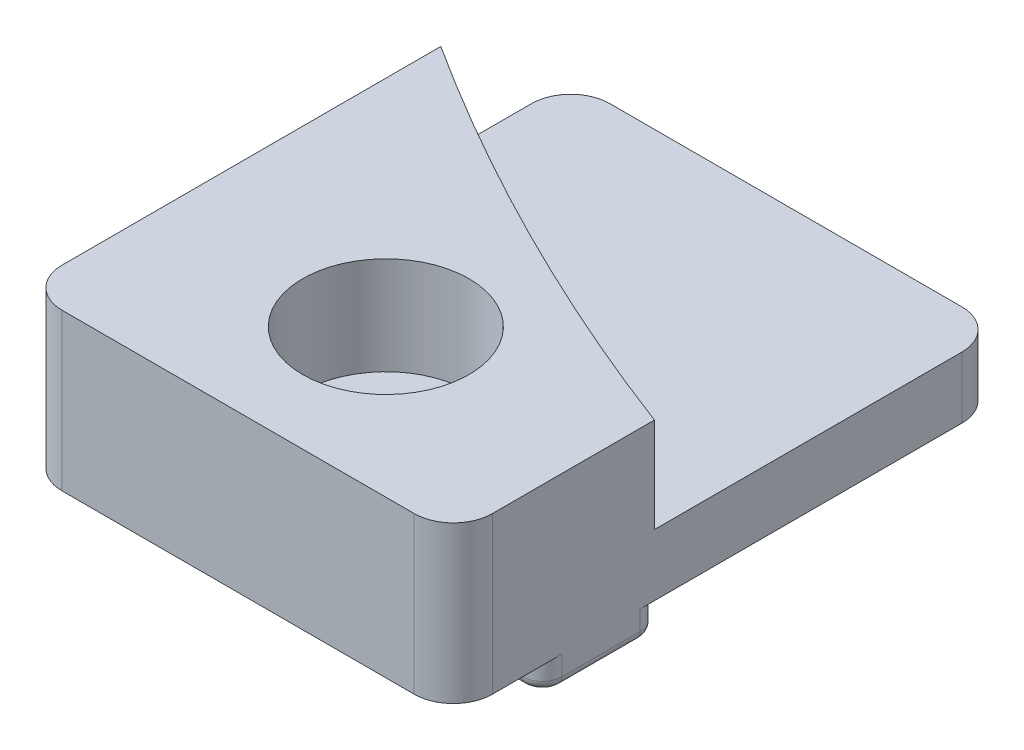
ISO-10303-21;
HEADER;
FILE_DESCRIPTION(('STEP AP214'),'2;1');
FILE_NAME('part.step','',(''),(''),'','','');
FILE_SCHEMA(('AUTOMOTIVE_DESIGN { 1 0 10303 214 1 1 1 1 }'));
ENDSEC;
DATA;
#1=APPLICATION_CONTEXT('core data for automotive mechanical design processes');
#2=APPLICATION_PROTOCOL_DEFINITION('international standard','automotive_design',2000,#1);
#3=PRODUCT_CONTEXT('',#1,'mechanical');
#4=PRODUCT('Part','Part','',(#3));
#5=PRODUCT_RELATED_PRODUCT_CATEGORY('part','',(#4));
#6=PRODUCT_DEFINITION_FORMATION('','',#4);
#7=PRODUCT_DEFINITION_CONTEXT('part definition',#1,'design');
#8=PRODUCT_DEFINITION('design','',#6,#7);
#9=PRODUCT_DEFINITION_SHAPE('','',#8);
#10=(LENGTH_UNIT() NAMED_UNIT(*) SI_UNIT(.MILLI.,.METRE.));
#11=(NAMED_UNIT(*) PLANE_ANGLE_UNIT() SI_UNIT($,.RADIAN.));
#12=(NAMED_UNIT(*) SI_UNIT($,.STERADIAN.) SOLID_ANGLE_UNIT());
#13=UNCERTAINTY_MEASURE_WITH_UNIT(LENGTH_MEASURE(1.E-05),#10,'distance_accuracy_value','');
#14=(GEOMETRIC_REPRESENTATION_CONTEXT(3) GLOBAL_UNCERTAINTY_ASSIGNED_CONTEXT((#13)) GLOBAL_UNIT_ASSIGNED_CONTEXT((#10,
#11,#12)) REPRESENTATION_CONTEXT('',''));
#15=CARTESIAN_POINT('',(0.,0.,0.));
#16=DIRECTION('',(0.,0.,1.));
#17=DIRECTION('',(1.,0.,0.));
#18=AXIS2_PLACEMENT_3D('',#15,#16,#17);
#19=CARTESIAN_POINT('',(11.,-1.5,-14.));
#20=DIRECTION('',(0.,0.,-1.));
#21=DIRECTION('',(-1.,0.,0.));
#22=AXIS2_PLACEMENT_3D('',#19,#20,#21);
#23=PLANE('',#22);
#24=DIRECTION('',(-1.,0.,0.));
#25=VECTOR('',#24,1.);
#26=CARTESIAN_POINT('',(11.,3.15,-14.));
#27=LINE('',#26,#25);
#28=CARTESIAN_POINT('',(9.,3.15,-14.));
#29=VERTEX_POINT('',#28);
#30=CARTESIAN_POINT('',(-9.,3.15,-14.));
#31=VERTEX_POINT('',#30);
#32=EDGE_CURVE('E200',#29,#31,#27,.T.);
#33=ORIENTED_EDGE('',*,*,#32,.F.);
#34=DIRECTION('',(0.,1.,0.));
#35=VECTOR('',#34,1.);
#36=CARTESIAN_POINT('',(9.,-1.5,-14.));
#37=LINE('',#36,#35);
#38=CARTESIAN_POINT('',(9.,0.,-14.));
#39=VERTEX_POINT('',#38);
#40=EDGE_CURVE('E336',#29,#39,#37,.F.);
#41=ORIENTED_EDGE('',*,*,#40,.T.);
#42=DIRECTION('',(-1.,0.,0.));
#43=VECTOR('',#42,1.);
#44=CARTESIAN_POINT('',(11.,0.,-14.));
#45=LINE('',#44,#43);
#46=CARTESIAN_POINT('',(-9.,0.,-14.));
#47=VERTEX_POINT('',#46);
#48=EDGE_CURVE('E227',#39,#47,#45,.T.);
#49=ORIENTED_EDGE('',*,*,#48,.T.);
#50=DIRECTION('',(0.,1.,0.));
#51=VECTOR('',#50,1.);
#52=CARTESIAN_POINT('',(-9.,-1.5,-14.));
#53=LINE('',#52,#51);
#54=EDGE_CURVE('E333',#47,#31,#53,.T.);
#55=ORIENTED_EDGE('',*,*,#54,.T.);
#56=EDGE_LOOP('',(#33,#41,#49,#55));
#57=FACE_BOUND('',#56,.T.);
#58=ADVANCED_FACE('F39',(#57),#23,.T.);
#59=CARTESIAN_POINT('',(11.,-1.5,14.));
#60=DIRECTION('',(1.,0.,0.));
#61=DIRECTION('',(0.,0.,-1.));
#62=AXIS2_PLACEMENT_3D('',#59,#60,#61);
#63=PLANE('',#62);
#64=DIRECTION('',(0.,0.,-1.));
#65=VECTOR('',#64,1.);
#66=CARTESIAN_POINT('',(11.,0.,3.45));
#67=LINE('',#66,#65);
#68=CARTESIAN_POINT('',(11.,0.,4.45));
#69=VERTEX_POINT('',#68);
#70=CARTESIAN_POINT('',(11.,0.,-12.));
#71=VERTEX_POINT('',#70);
#72=EDGE_CURVE('E221',#69,#71,#67,.T.);
#73=ORIENTED_EDGE('',*,*,#72,.T.);
#74=DIRECTION('',(0.,1.,0.));
#75=VECTOR('',#74,1.);
#76=CARTESIAN_POINT('',(11.,-1.5,-12.));
#77=LINE('',#76,#75);
#78=CARTESIAN_POINT('',(11.,3.15,-12.));
#79=VERTEX_POINT('',#78);
#80=EDGE_CURVE('E327',#71,#79,#77,.T.);
#81=ORIENTED_EDGE('',*,*,#80,.T.);
#82=DIRECTION('',(0.,0.,-1.));
#83=VECTOR('',#82,1.);
#84=CARTESIAN_POINT('',(11.,3.15,3.71881430774099));
#85=LINE('',#84,#83);
#86=CARTESIAN_POINT('',(11.,3.15,3.71881430774094));
#87=VERTEX_POINT('',#86);
#88=EDGE_CURVE('E209',#87,#79,#85,.T.);
#89=ORIENTED_EDGE('',*,*,#88,.F.);
#90=DIRECTION('',(0.,1.,0.));
#91=VECTOR('',#90,1.);
#92=CARTESIAN_POINT('',(11.,3.15,3.71881430774094));
#93=LINE('',#92,#91);
#94=CARTESIAN_POINT('',(11.,8.,3.71881430774094));
#95=VERTEX_POINT('',#94);
#96=EDGE_CURVE('E208',#87,#95,#93,.T.);
#97=ORIENTED_EDGE('',*,*,#96,.T.);
#98=DIRECTION('',(0.,0.,-1.));
#99=VECTOR('',#98,1.);
#100=CARTESIAN_POINT('',(11.,8.,14.));
#101=LINE('',#100,#99);
#102=CARTESIAN_POINT('',(11.,8.,12.));
#103=VERTEX_POINT('',#102);
#104=EDGE_CURVE('E235',#103,#95,#101,.T.);
#105=ORIENTED_EDGE('',*,*,#104,.F.);
#106=DIRECTION('',(0.,1.,0.));
#107=VECTOR('',#106,1.);
#108=CARTESIAN_POINT('',(11.,-1.5,12.));
#109=LINE('',#108,#107);
#110=CARTESIAN_POINT('',(11.,0.,12.));
#111=VERTEX_POINT('',#110);
#112=EDGE_CURVE('E302',#103,#111,#109,.F.);
#113=ORIENTED_EDGE('',*,*,#112,.T.);
#114=DIRECTION('',(0.,0.,-1.));
#115=VECTOR('',#114,1.);
#116=CARTESIAN_POINT('',(11.,0.,14.));
#117=LINE('',#116,#115);
#118=CARTESIAN_POINT('',(11.,0.,8.45));
#119=VERTEX_POINT('',#118);
#120=EDGE_CURVE('E365',#111,#119,#117,.T.);
#121=ORIENTED_EDGE('',*,*,#120,.T.);
#122=DIRECTION('',(0.,-1.,0.));
#123=VECTOR('',#122,1.);
#124=CARTESIAN_POINT('',(11.,-1.5,8.45));
#125=LINE('',#124,#123);
#126=CARTESIAN_POINT('',(11.,-1.,8.45));
#127=VERTEX_POINT('',#126);
#128=EDGE_CURVE('E248',#119,#127,#125,.T.);
#129=ORIENTED_EDGE('',*,*,#128,.T.);
#130=DIRECTION('',(0.,0.,-1.));
#131=VECTOR('',#130,1.);
#132=CARTESIAN_POINT('',(11.,-1.,4.45));
#133=LINE('',#132,#131);
#134=CARTESIAN_POINT('',(11.,-1.,4.45));
#135=VERTEX_POINT('',#134);
#136=EDGE_CURVE('E298',#127,#135,#133,.T.);
#137=ORIENTED_EDGE('',*,*,#136,.T.);
#138=DIRECTION('',(0.,1.,0.));
#139=VECTOR('',#138,1.);
#140=CARTESIAN_POINT('',(11.,0.,4.45));
#141=LINE('',#140,#139);
#142=EDGE_CURVE('E251',#135,#69,#141,.T.);
#143=ORIENTED_EDGE('',*,*,#142,.T.);
#144=EDGE_LOOP('',(#73,#81,#89,#97,#105,#113,#121,#129,#137,#143));
#145=FACE_BOUND('',#144,.T.);
#146=ADVANCED_FACE('F373',(#145),#63,.T.);
#147=CARTESIAN_POINT('',(-11.,-1.5,14.));
#148=DIRECTION('',(0.,0.,1.));
#149=DIRECTION('',(1.,0.,0.));
#150=AXIS2_PLACEMENT_3D('',#147,#148,#149);
#151=PLANE('',#150);
#152=DIRECTION('',(-1.,0.,0.));
#153=VECTOR('',#152,1.);
#154=CARTESIAN_POINT('',(11.,0.,14.));
#155=LINE('',#154,#153);
#156=CARTESIAN_POINT('',(9.,0.,14.));
#157=VERTEX_POINT('',#156);
#158=CARTESIAN_POINT('',(-9.,0.,14.));
#159=VERTEX_POINT('',#158);
#160=EDGE_CURVE('E359',#157,#159,#155,.T.);
#161=ORIENTED_EDGE('',*,*,#160,.F.);
#162=DIRECTION('',(0.,1.,0.));
#163=VECTOR('',#162,1.);
#164=CARTESIAN_POINT('',(9.,-1.5,14.));
#165=LINE('',#164,#163);
#166=CARTESIAN_POINT('',(9.,8.,14.));
#167=VERTEX_POINT('',#166);
#168=EDGE_CURVE('E348',#157,#167,#165,.T.);
#169=ORIENTED_EDGE('',*,*,#168,.T.);
#170=DIRECTION('',(1.,0.,0.));
#171=VECTOR('',#170,1.);
#172=CARTESIAN_POINT('',(-11.,8.,14.));
#173=LINE('',#172,#171);
#174=CARTESIAN_POINT('',(-9.,8.,14.));
#175=VERTEX_POINT('',#174);
#176=EDGE_CURVE('E233',#175,#167,#173,.T.);
#177=ORIENTED_EDGE('',*,*,#176,.F.);
#178=DIRECTION('',(0.,1.,0.));
#179=VECTOR('',#178,1.);
#180=CARTESIAN_POINT('',(-9.,-1.5,14.));
#181=LINE('',#180,#179);
#182=EDGE_CURVE('E346',#175,#159,#181,.F.);
#183=ORIENTED_EDGE('',*,*,#182,.T.);
#184=EDGE_LOOP('',(#161,#169,#177,#183));
#185=FACE_BOUND('',#184,.T.);
#186=ADVANCED_FACE('F369',(#185),#151,.T.);
#187=CARTESIAN_POINT('',(-11.,-1.5,-14.));
#188=DIRECTION('',(-1.,0.,0.));
#189=DIRECTION('',(0.,0.,1.));
#190=AXIS2_PLACEMENT_3D('',#187,#188,#189);
#191=PLANE('',#190);
#192=DIRECTION('',(0.,0.,1.));
#193=VECTOR('',#192,1.);
#194=CARTESIAN_POINT('',(-11.,3.15,-14.));
#195=LINE('',#194,#193);
#196=CARTESIAN_POINT('',(-11.,3.15,-12.));
#197=VERTEX_POINT('',#196);
#198=CARTESIAN_POINT('',(-11.,3.15,-7.35859212357451));
#199=VERTEX_POINT('',#198);
#200=EDGE_CURVE('E189',#197,#199,#195,.T.);
#201=ORIENTED_EDGE('',*,*,#200,.F.);
#202=DIRECTION('',(0.,1.,0.));
#203=VECTOR('',#202,1.);
#204=CARTESIAN_POINT('',(-11.,-1.5,-12.));
#205=LINE('',#204,#203);
#206=CARTESIAN_POINT('',(-11.,0.,-12.));
#207=VERTEX_POINT('',#206);
#208=EDGE_CURVE('E344',#197,#207,#205,.F.);
#209=ORIENTED_EDGE('',*,*,#208,.T.);
#210=DIRECTION('',(0.,0.,-1.));
#211=VECTOR('',#210,1.);
#212=CARTESIAN_POINT('',(-11.,0.,3.45));
#213=LINE('',#212,#211);
#214=CARTESIAN_POINT('',(-11.,0.,4.45));
#215=VERTEX_POINT('',#214);
#216=EDGE_CURVE('E216',#215,#207,#213,.T.);
#217=ORIENTED_EDGE('',*,*,#216,.F.);
#218=DIRECTION('',(0.,1.,0.));
#219=VECTOR('',#218,1.);
#220=CARTESIAN_POINT('',(-11.,-1.5,4.45));
#221=LINE('',#220,#219);
#222=CARTESIAN_POINT('',(-11.,-1.,4.45));
#223=VERTEX_POINT('',#222);
#224=EDGE_CURVE('E245',#215,#223,#221,.F.);
#225=ORIENTED_EDGE('',*,*,#224,.T.);
#226=DIRECTION('',(0.,0.,1.));
#227=VECTOR('',#226,1.);
#228=CARTESIAN_POINT('',(-11.,-1.,8.45));
#229=LINE('',#228,#227);
#230=CARTESIAN_POINT('',(-11.,-1.,8.45));
#231=VERTEX_POINT('',#230);
#232=EDGE_CURVE('E288',#223,#231,#229,.T.);
#233=ORIENTED_EDGE('',*,*,#232,.T.);
#234=DIRECTION('',(0.,-1.,0.));
#235=VECTOR('',#234,1.);
#236=CARTESIAN_POINT('',(-11.,0.,8.45));
#237=LINE('',#236,#235);
#238=CARTESIAN_POINT('',(-11.,0.,8.45));
#239=VERTEX_POINT('',#238);
#240=EDGE_CURVE('E242',#231,#239,#237,.F.);
#241=ORIENTED_EDGE('',*,*,#240,.T.);
#242=DIRECTION('',(0.,0.,-1.));
#243=VECTOR('',#242,1.);
#244=CARTESIAN_POINT('',(-11.,0.,14.));
#245=LINE('',#244,#243);
#246=CARTESIAN_POINT('',(-11.,0.,12.));
#247=VERTEX_POINT('',#246);
#248=EDGE_CURVE('E357',#247,#239,#245,.T.);
#249=ORIENTED_EDGE('',*,*,#248,.F.);
#250=DIRECTION('',(0.,1.,0.));
#251=VECTOR('',#250,1.);
#252=CARTESIAN_POINT('',(-11.,-1.5,12.));
#253=LINE('',#252,#251);
#254=CARTESIAN_POINT('',(-11.,8.,12.));
#255=VERTEX_POINT('',#254);
#256=EDGE_CURVE('E342',#247,#255,#253,.T.);
#257=ORIENTED_EDGE('',*,*,#256,.T.);
#258=DIRECTION('',(0.,0.,1.));
#259=VECTOR('',#258,1.);
#260=CARTESIAN_POINT('',(-11.,8.,-14.));
#261=LINE('',#260,#259);
#262=CARTESIAN_POINT('',(-11.,8.,-7.35859212357451));
#263=VERTEX_POINT('',#262);
#264=EDGE_CURVE('E214',#263,#255,#261,.T.);
#265=ORIENTED_EDGE('',*,*,#264,.F.);
#266=DIRECTION('',(0.,1.,0.));
#267=VECTOR('',#266,1.);
#268=CARTESIAN_POINT('',(-11.,3.15,-7.35859212357451));
#269=LINE('',#268,#267);
#270=EDGE_CURVE('E205',#199,#263,#269,.T.);
#271=ORIENTED_EDGE('',*,*,#270,.F.);
#272=EDGE_LOOP('',(#201,#209,#217,#225,#233,#241,#249,#257,#265,#271));
#273=FACE_BOUND('',#272,.T.);
#274=ADVANCED_FACE('F212',(#273),#191,.T.);
#275=CARTESIAN_POINT('',(0.,-1.5,0.));
#276=DIRECTION('',(0.,1.,0.));
#277=DIRECTION('',(0.,0.,1.));
#278=AXIS2_PLACEMENT_3D('',#275,#276,#277);
#279=PLANE('',#278);
#280=DIRECTION('',(0.,0.,1.));
#281=VECTOR('',#280,1.);
#282=CARTESIAN_POINT('',(-10.5,-1.5,4.45));
#283=LINE('',#282,#281);
#284=CARTESIAN_POINT('',(-10.5,-1.5,8.45));
#285=VERTEX_POINT('',#284);
#286=CARTESIAN_POINT('',(-10.5,-1.5,4.45));
#287=VERTEX_POINT('',#286);
#288=EDGE_CURVE('E280',#285,#287,#283,.F.);
#289=ORIENTED_EDGE('',*,*,#288,.T.);
#290=CARTESIAN_POINT('',(-10.,-1.5,4.45));
#291=DIRECTION('',(0.,1.,0.));
#292=DIRECTION('',(0.,0.,1.));
#293=AXIS2_PLACEMENT_3D('',#290,#291,#292);
#294=CIRCLE('',#293,0.5);
#295=CARTESIAN_POINT('',(-10.,-1.5,3.95));
#296=VERTEX_POINT('',#295);
#297=EDGE_CURVE('E282',#287,#296,#294,.F.);
#298=ORIENTED_EDGE('',*,*,#297,.T.);
#299=DIRECTION('',(-1.,0.,0.));
#300=VECTOR('',#299,1.);
#301=CARTESIAN_POINT('',(0.,-1.5,3.95));
#302=LINE('',#301,#300);
#303=CARTESIAN_POINT('',(10.,-1.5,3.95));
#304=VERTEX_POINT('',#303);
#305=EDGE_CURVE('E278',#296,#304,#302,.F.);
#306=ORIENTED_EDGE('',*,*,#305,.T.);
#307=CARTESIAN_POINT('',(10.,-1.5,4.45));
#308=DIRECTION('',(0.,1.,0.));
#309=DIRECTION('',(0.,0.,1.));
#310=AXIS2_PLACEMENT_3D('',#307,#308,#309);
#311=CIRCLE('',#310,0.5);
#312=CARTESIAN_POINT('',(10.5,-1.5,4.45));
#313=VERTEX_POINT('',#312);
#314=EDGE_CURVE('E274',#304,#313,#311,.F.);
#315=ORIENTED_EDGE('',*,*,#314,.T.);
#316=DIRECTION('',(0.,0.,-1.));
#317=VECTOR('',#316,1.);
#318=CARTESIAN_POINT('',(10.5,-1.5,8.45));
#319=LINE('',#318,#317);
#320=CARTESIAN_POINT('',(10.5,-1.5,8.45));
#321=VERTEX_POINT('',#320);
#322=EDGE_CURVE('E270',#313,#321,#319,.F.);
#323=ORIENTED_EDGE('',*,*,#322,.T.);
#324=CARTESIAN_POINT('',(10.,-1.5,8.45));
#325=DIRECTION('',(0.,1.,0.));
#326=DIRECTION('',(0.,0.,1.));
#327=AXIS2_PLACEMENT_3D('',#324,#325,#326);
#328=CIRCLE('',#327,0.5);
#329=CARTESIAN_POINT('',(10.,-1.5,8.95));
#330=VERTEX_POINT('',#329);
#331=EDGE_CURVE('E268',#321,#330,#328,.F.);
#332=ORIENTED_EDGE('',*,*,#331,.T.);
#333=DIRECTION('',(-1.,0.,0.));
#334=VECTOR('',#333,1.);
#335=CARTESIAN_POINT('',(0.,-1.5,8.95));
#336=LINE('',#335,#334);
#337=CARTESIAN_POINT('',(-10.,-1.5,8.95));
#338=VERTEX_POINT('',#337);
#339=EDGE_CURVE('E272',#330,#338,#336,.T.);
#340=ORIENTED_EDGE('',*,*,#339,.T.);
#341=CARTESIAN_POINT('',(-10.,-1.5,8.45));
#342=DIRECTION('',(0.,1.,0.));
#343=DIRECTION('',(0.,0.,1.));
#344=AXIS2_PLACEMENT_3D('',#341,#342,#343);
#345=CIRCLE('',#344,0.5);
#346=EDGE_CURVE('E276',#338,#285,#345,.F.);
#347=ORIENTED_EDGE('',*,*,#346,.T.);
#348=EDGE_LOOP('',(#289,#298,#306,#315,#323,#332,#340,#347));
#349=FACE_BOUND('',#348,.T.);
#350=CARTESIAN_POINT('',(0.,-1.49999999999999,6.45));
#351=DIRECTION('',(0.,1.,0.));
#352=DIRECTION('',(0.,0.,1.));
#353=AXIS2_PLACEMENT_3D('',#350,#351,#352);
#354=CIRCLE('',#353,2.15000000000001);
#355=CARTESIAN_POINT('',(0.,-1.49999999999999,8.60000000000001));
#356=VERTEX_POINT('',#355);
#357=EDGE_CURVE('E366',#356,#356,#354,.T.);
#358=ORIENTED_EDGE('',*,*,#357,.T.);
#359=EDGE_LOOP('',(#358));
#360=FACE_BOUND('',#359,.T.);
#361=ADVANCED_FACE('F462',(#349,#360),#279,.F.);
#362=CARTESIAN_POINT('',(0.,8.,0.));
#363=DIRECTION('',(0.,1.,0.));
#364=DIRECTION('',(0.,0.,1.));
#365=AXIS2_PLACEMENT_3D('',#362,#363,#364);
#366=PLANE('',#365);
#367=CARTESIAN_POINT('',(0.,8.,6.45));
#368=DIRECTION('',(0.,1.,0.));
#369=DIRECTION('',(0.,0.,1.));
#370=AXIS2_PLACEMENT_3D('',#367,#368,#369);
#371=CIRCLE('',#370,4.24999999999999);
#372=CARTESIAN_POINT('',(0.,8.,10.7));
#373=VERTEX_POINT('',#372);
#374=EDGE_CURVE('E325',#373,#373,#371,.T.);
#375=ORIENTED_EDGE('',*,*,#374,.F.);
#376=EDGE_LOOP('',(#375));
#377=FACE_BOUND('',#376,.T.);
#378=ORIENTED_EDGE('',*,*,#176,.T.);
#379=CARTESIAN_POINT('',(9.,8.,12.));
#380=DIRECTION('',(0.,1.,0.));
#381=DIRECTION('',(0.,0.,1.));
#382=AXIS2_PLACEMENT_3D('',#379,#380,#381);
#383=CIRCLE('',#382,2.);
#384=EDGE_CURVE('E54',#167,#103,#383,.T.);
#385=ORIENTED_EDGE('',*,*,#384,.T.);
#386=ORIENTED_EDGE('',*,*,#104,.T.);
#387=CARTESIAN_POINT('',(53.23,8.,-107.535970308474));
#388=DIRECTION('',(0.,1.,0.));
#389=DIRECTION('',(0.,0.,1.));
#390=AXIS2_PLACEMENT_3D('',#387,#388,#389);
#391=CIRCLE('',#390,119.000000000002);
#392=EDGE_CURVE('E386',#263,#95,#391,.T.);
#393=ORIENTED_EDGE('',*,*,#392,.F.);
#394=ORIENTED_EDGE('',*,*,#264,.T.);
#395=CARTESIAN_POINT('',(-9.,8.,12.));
#396=DIRECTION('',(0.,1.,0.));
#397=DIRECTION('',(0.,0.,1.));
#398=AXIS2_PLACEMENT_3D('',#395,#396,#397);
#399=CIRCLE('',#398,2.);
#400=EDGE_CURVE('E62',#255,#175,#399,.T.);
#401=ORIENTED_EDGE('',*,*,#400,.T.);
#402=EDGE_LOOP('',(#378,#385,#386,#393,#394,#401));
#403=FACE_BOUND('',#402,.T.);
#404=ADVANCED_FACE('F370',(#377,#403),#366,.T.);
#405=CARTESIAN_POINT('',(11.,0.,3.45));
#406=DIRECTION('',(0.,1.,0.));
#407=DIRECTION('',(0.,0.,1.));
#408=AXIS2_PLACEMENT_3D('',#405,#406,#407);
#409=PLANE('',#408);
#410=ORIENTED_EDGE('',*,*,#48,.F.);
#411=CARTESIAN_POINT('',(9.,0.,-12.));
#412=DIRECTION('',(0.,1.,0.));
#413=DIRECTION('',(0.,0.,1.));
#414=AXIS2_PLACEMENT_3D('',#411,#412,#413);
#415=CIRCLE('',#414,2.);
#416=EDGE_CURVE('E340',#39,#71,#415,.F.);
#417=ORIENTED_EDGE('',*,*,#416,.T.);
#418=ORIENTED_EDGE('',*,*,#72,.F.);
#419=CARTESIAN_POINT('',(10.,0.,4.45));
#420=DIRECTION('',(0.,1.,0.));
#421=DIRECTION('',(0.,0.,1.));
#422=AXIS2_PLACEMENT_3D('',#419,#420,#421);
#423=CIRCLE('',#422,1.);
#424=CARTESIAN_POINT('',(10.,0.,3.45));
#425=VERTEX_POINT('',#424);
#426=EDGE_CURVE('E261',#69,#425,#423,.T.);
#427=ORIENTED_EDGE('',*,*,#426,.T.);
#428=DIRECTION('',(-1.,0.,0.));
#429=VECTOR('',#428,1.);
#430=CARTESIAN_POINT('',(11.,0.,3.45));
#431=LINE('',#430,#429);
#432=CARTESIAN_POINT('',(-10.,0.,3.45));
#433=VERTEX_POINT('',#432);
#434=EDGE_CURVE('E224',#425,#433,#431,.T.);
#435=ORIENTED_EDGE('',*,*,#434,.T.);
#436=CARTESIAN_POINT('',(-10.,0.,4.45));
#437=DIRECTION('',(0.,1.,0.));
#438=DIRECTION('',(0.,0.,1.));
#439=AXIS2_PLACEMENT_3D('',#436,#437,#438);
#440=CIRCLE('',#439,1.);
#441=EDGE_CURVE('E258',#433,#215,#440,.T.);
#442=ORIENTED_EDGE('',*,*,#441,.T.);
#443=ORIENTED_EDGE('',*,*,#216,.T.);
#444=CARTESIAN_POINT('',(-9.,0.,-12.));
#445=DIRECTION('',(0.,1.,0.));
#446=DIRECTION('',(0.,0.,1.));
#447=AXIS2_PLACEMENT_3D('',#444,#445,#446);
#448=CIRCLE('',#447,2.);
#449=EDGE_CURVE('E338',#207,#47,#448,.F.);
#450=ORIENTED_EDGE('',*,*,#449,.T.);
#451=EDGE_LOOP('',(#410,#417,#418,#427,#435,#442,#443,#450));
#452=FACE_BOUND('',#451,.T.);
#453=ADVANCED_FACE('F399',(#452),#409,.F.);
#454=CARTESIAN_POINT('',(11.,-1.5,3.45));
#455=DIRECTION('',(0.,0.,1.));
#456=DIRECTION('',(1.,0.,0.));
#457=AXIS2_PLACEMENT_3D('',#454,#455,#456);
#458=PLANE('',#457);
#459=DIRECTION('',(0.,1.,0.));
#460=VECTOR('',#459,1.);
#461=CARTESIAN_POINT('',(10.,-1.5,3.45));
#462=LINE('',#461,#460);
#463=CARTESIAN_POINT('',(10.,-1.,3.45));
#464=VERTEX_POINT('',#463);
#465=EDGE_CURVE('E237',#425,#464,#462,.F.);
#466=ORIENTED_EDGE('',*,*,#465,.T.);
#467=DIRECTION('',(-1.,0.,0.));
#468=VECTOR('',#467,1.);
#469=CARTESIAN_POINT('',(11.,-1.,3.45));
#470=LINE('',#469,#468);
#471=CARTESIAN_POINT('',(-10.,-1.,3.45));
#472=VERTEX_POINT('',#471);
#473=EDGE_CURVE('E290',#464,#472,#470,.T.);
#474=ORIENTED_EDGE('',*,*,#473,.T.);
#475=DIRECTION('',(0.,1.,0.));
#476=VECTOR('',#475,1.);
#477=CARTESIAN_POINT('',(-10.,0.,3.45));
#478=LINE('',#477,#476);
#479=EDGE_CURVE('E240',#472,#433,#478,.T.);
#480=ORIENTED_EDGE('',*,*,#479,.T.);
#481=ORIENTED_EDGE('',*,*,#434,.F.);
#482=EDGE_LOOP('',(#466,#474,#480,#481));
#483=FACE_BOUND('',#482,.T.);
#484=ADVANCED_FACE('F422',(#483),#458,.F.);
#485=CARTESIAN_POINT('',(53.23,3.15,-107.535970308474));
#486=DIRECTION('',(0.,1.,0.));
#487=DIRECTION('',(0.,0.,1.));
#488=AXIS2_PLACEMENT_3D('',#485,#486,#487);
#489=CYLINDRICAL_SURFACE('',#488,119.000000000002);
#490=ORIENTED_EDGE('',*,*,#392,.T.);
#491=ORIENTED_EDGE('',*,*,#96,.F.);
#492=CARTESIAN_POINT('',(53.23,3.15,-107.535970308474));
#493=DIRECTION('',(0.,1.,0.));
#494=DIRECTION('',(0.,0.,1.));
#495=AXIS2_PLACEMENT_3D('',#492,#493,#494);
#496=CIRCLE('',#495,119.000000000002);
#497=EDGE_CURVE('E193',#199,#87,#496,.T.);
#498=ORIENTED_EDGE('',*,*,#497,.F.);
#499=ORIENTED_EDGE('',*,*,#270,.T.);
#500=EDGE_LOOP('',(#490,#491,#498,#499));
#501=FACE_BOUND('',#500,.T.);
#502=ADVANCED_FACE('F204',(#501),#489,.F.);
#503=CARTESIAN_POINT('',(53.23,3.15,-107.535970308474));
#504=DIRECTION('',(0.,1.,0.));
#505=DIRECTION('',(0.,0.,1.));
#506=AXIS2_PLACEMENT_3D('',#503,#504,#505);
#507=PLANE('',#506);
#508=ORIENTED_EDGE('',*,*,#88,.T.);
#509=CARTESIAN_POINT('',(9.,3.15,-12.));
#510=DIRECTION('',(0.,1.,0.));
#511=DIRECTION('',(0.,0.,1.));
#512=AXIS2_PLACEMENT_3D('',#509,#510,#511);
#513=CIRCLE('',#512,2.);
#514=EDGE_CURVE('E331',#79,#29,#513,.T.);
#515=ORIENTED_EDGE('',*,*,#514,.T.);
#516=ORIENTED_EDGE('',*,*,#32,.T.);
#517=CARTESIAN_POINT('',(-9.,3.15,-12.));
#518=DIRECTION('',(0.,1.,0.));
#519=DIRECTION('',(0.,0.,1.));
#520=AXIS2_PLACEMENT_3D('',#517,#518,#519);
#521=CIRCLE('',#520,2.);
#522=EDGE_CURVE('E196',#31,#197,#521,.T.);
#523=ORIENTED_EDGE('',*,*,#522,.T.);
#524=ORIENTED_EDGE('',*,*,#200,.T.);
#525=ORIENTED_EDGE('',*,*,#497,.T.);
#526=EDGE_LOOP('',(#508,#515,#516,#523,#524,#525));
#527=FACE_BOUND('',#526,.T.);
#528=ADVANCED_FACE('F192',(#527),#507,.T.);
#529=CARTESIAN_POINT('',(11.,0.,9.45));
#530=DIRECTION('',(0.,0.,-1.));
#531=DIRECTION('',(-1.,0.,0.));
#532=AXIS2_PLACEMENT_3D('',#529,#530,#531);
#533=PLANE('',#532);
#534=DIRECTION('',(0.,-1.,0.));
#535=VECTOR('',#534,1.);
#536=CARTESIAN_POINT('',(-10.,-1.5,9.45));
#537=LINE('',#536,#535);
#538=CARTESIAN_POINT('',(-10.,0.,9.45));
#539=VERTEX_POINT('',#538);
#540=CARTESIAN_POINT('',(-10.,-1.,9.45));
#541=VERTEX_POINT('',#540);
#542=EDGE_CURVE('E255',#539,#541,#537,.T.);
#543=ORIENTED_EDGE('',*,*,#542,.T.);
#544=DIRECTION('',(-1.,0.,0.));
#545=VECTOR('',#544,1.);
#546=CARTESIAN_POINT('',(11.,-1.,9.45));
#547=LINE('',#546,#545);
#548=CARTESIAN_POINT('',(10.,-1.,9.45));
#549=VERTEX_POINT('',#548);
#550=EDGE_CURVE('E296',#541,#549,#547,.F.);
#551=ORIENTED_EDGE('',*,*,#550,.T.);
#552=DIRECTION('',(0.,-1.,0.));
#553=VECTOR('',#552,1.);
#554=CARTESIAN_POINT('',(10.,0.,9.45));
#555=LINE('',#554,#553);
#556=CARTESIAN_POINT('',(10.,0.,9.45));
#557=VERTEX_POINT('',#556);
#558=EDGE_CURVE('E253',#549,#557,#555,.F.);
#559=ORIENTED_EDGE('',*,*,#558,.T.);
#560=DIRECTION('',(-1.,0.,0.));
#561=VECTOR('',#560,1.);
#562=CARTESIAN_POINT('',(11.,0.,9.45));
#563=LINE('',#562,#561);
#564=EDGE_CURVE('E380',#557,#539,#563,.T.);
#565=ORIENTED_EDGE('',*,*,#564,.T.);
#566=EDGE_LOOP('',(#543,#551,#559,#565));
#567=FACE_BOUND('',#566,.T.);
#568=ADVANCED_FACE('F453',(#567),#533,.F.);
#569=CARTESIAN_POINT('',(11.,0.,14.));
#570=DIRECTION('',(0.,1.,0.));
#571=DIRECTION('',(0.,0.,1.));
#572=AXIS2_PLACEMENT_3D('',#569,#570,#571);
#573=PLANE('',#572);
#574=ORIENTED_EDGE('',*,*,#120,.F.);
#575=CARTESIAN_POINT('',(9.,0.,12.));
#576=DIRECTION('',(0.,1.,0.));
#577=DIRECTION('',(0.,0.,1.));
#578=AXIS2_PLACEMENT_3D('',#575,#576,#577);
#579=CIRCLE('',#578,2.);
#580=EDGE_CURVE('E11',#111,#157,#579,.F.);
#581=ORIENTED_EDGE('',*,*,#580,.T.);
#582=ORIENTED_EDGE('',*,*,#160,.T.);
#583=CARTESIAN_POINT('',(-9.,0.,12.));
#584=DIRECTION('',(0.,1.,0.));
#585=DIRECTION('',(0.,0.,1.));
#586=AXIS2_PLACEMENT_3D('',#583,#584,#585);
#587=CIRCLE('',#586,2.);
#588=EDGE_CURVE('E47',#159,#247,#587,.F.);
#589=ORIENTED_EDGE('',*,*,#588,.T.);
#590=ORIENTED_EDGE('',*,*,#248,.T.);
#591=CARTESIAN_POINT('',(-10.,0.,8.45));
#592=DIRECTION('',(0.,1.,0.));
#593=DIRECTION('',(0.,0.,1.));
#594=AXIS2_PLACEMENT_3D('',#591,#592,#593);
#595=CIRCLE('',#594,1.);
#596=EDGE_CURVE('E263',#239,#539,#595,.T.);
#597=ORIENTED_EDGE('',*,*,#596,.T.);
#598=ORIENTED_EDGE('',*,*,#564,.F.);
#599=CARTESIAN_POINT('',(10.,0.,8.45));
#600=DIRECTION('',(0.,1.,0.));
#601=DIRECTION('',(0.,0.,1.));
#602=AXIS2_PLACEMENT_3D('',#599,#600,#601);
#603=CIRCLE('',#602,1.);
#604=EDGE_CURVE('E265',#557,#119,#603,.T.);
#605=ORIENTED_EDGE('',*,*,#604,.T.);
#606=EDGE_LOOP('',(#574,#581,#582,#589,#590,#597,#598,#605));
#607=FACE_BOUND('',#606,.T.);
#608=ADVANCED_FACE('F356',(#607),#573,.F.);
#609=CARTESIAN_POINT('',(0.,8.,6.45));
#610=DIRECTION('',(0.,1.,0.));
#611=DIRECTION('',(0.,0.,1.));
#612=AXIS2_PLACEMENT_3D('',#609,#610,#611);
#613=CYLINDRICAL_SURFACE('',#612,2.15000000000001);
#614=ORIENTED_EDGE('',*,*,#357,.F.);
#615=EDGE_LOOP('',(#614));
#616=FACE_BOUND('',#615,.T.);
#617=CARTESIAN_POINT('',(0.,3.,6.45));
#618=DIRECTION('',(0.,1.,0.));
#619=DIRECTION('',(0.,0.,1.));
#620=AXIS2_PLACEMENT_3D('',#617,#618,#619);
#621=CIRCLE('',#620,2.15000000000001);
#622=CARTESIAN_POINT('',(0.,3.,8.60000000000001));
#623=VERTEX_POINT('',#622);
#624=EDGE_CURVE('E469',#623,#623,#621,.T.);
#625=ORIENTED_EDGE('',*,*,#624,.T.);
#626=EDGE_LOOP('',(#625));
#627=FACE_BOUND('',#626,.T.);
#628=ADVANCED_FACE('F558',(#616,#627),#613,.F.);
#629=CARTESIAN_POINT('',(2.15000000000001,3.,6.45));
#630=DIRECTION('',(0.,-1.,0.));
#631=DIRECTION('',(0.,0.,-1.));
#632=AXIS2_PLACEMENT_3D('',#629,#630,#631);
#633=PLANE('',#632);
#634=ORIENTED_EDGE('',*,*,#624,.F.);
#635=EDGE_LOOP('',(#634));
#636=FACE_BOUND('',#635,.T.);
#637=CARTESIAN_POINT('',(0.,3.,6.45));
#638=DIRECTION('',(0.,1.,0.));
#639=DIRECTION('',(0.,0.,1.));
#640=AXIS2_PLACEMENT_3D('',#637,#638,#639);
#641=CIRCLE('',#640,4.24999999999999);
#642=CARTESIAN_POINT('',(0.,3.,10.7));
#643=VERTEX_POINT('',#642);
#644=EDGE_CURVE('E471',#643,#643,#641,.T.);
#645=ORIENTED_EDGE('',*,*,#644,.T.);
#646=EDGE_LOOP('',(#645));
#647=FACE_BOUND('',#646,.T.);
#648=ADVANCED_FACE('F710',(#636,#647),#633,.F.);
#649=CARTESIAN_POINT('',(0.,8.,6.45));
#650=DIRECTION('',(0.,1.,0.));
#651=DIRECTION('',(0.,0.,1.));
#652=AXIS2_PLACEMENT_3D('',#649,#650,#651);
#653=CYLINDRICAL_SURFACE('',#652,4.24999999999999);
#654=ORIENTED_EDGE('',*,*,#644,.F.);
#655=EDGE_LOOP('',(#654));
#656=FACE_BOUND('',#655,.T.);
#657=ORIENTED_EDGE('',*,*,#374,.T.);
#658=EDGE_LOOP('',(#657));
#659=FACE_BOUND('',#658,.T.);
#660=ADVANCED_FACE('F480',(#656,#659),#653,.F.);
#661=CARTESIAN_POINT('',(-10.,-1.5,4.45));
#662=DIRECTION('',(0.,-1.,0.));
#663=DIRECTION('',(0.,0.,-1.));
#664=AXIS2_PLACEMENT_3D('',#661,#662,#663);
#665=CYLINDRICAL_SURFACE('',#664,1.);
#666=ORIENTED_EDGE('',*,*,#479,.F.);
#667=CARTESIAN_POINT('',(-10.,-1.,4.45));
#668=DIRECTION('',(0.,1.,0.));
#669=DIRECTION('',(0.,0.,1.));
#670=AXIS2_PLACEMENT_3D('',#667,#668,#669);
#671=CIRCLE('',#670,1.);
#672=EDGE_CURVE('E285',#472,#223,#671,.T.);
#673=ORIENTED_EDGE('',*,*,#672,.T.);
#674=ORIENTED_EDGE('',*,*,#224,.F.);
#675=ORIENTED_EDGE('',*,*,#441,.F.);
#676=EDGE_LOOP('',(#666,#673,#674,#675));
#677=FACE_BOUND('',#676,.T.);
#678=ADVANCED_FACE('F427',(#677),#665,.T.);
#679=CARTESIAN_POINT('',(10.,-1.5,4.45));
#680=DIRECTION('',(0.,-1.,0.));
#681=DIRECTION('',(0.,0.,-1.));
#682=AXIS2_PLACEMENT_3D('',#679,#680,#681);
#683=CYLINDRICAL_SURFACE('',#682,1.);
#684=ORIENTED_EDGE('',*,*,#142,.F.);
#685=CARTESIAN_POINT('',(10.,-1.,4.45));
#686=DIRECTION('',(0.,1.,0.));
#687=DIRECTION('',(0.,0.,1.));
#688=AXIS2_PLACEMENT_3D('',#685,#686,#687);
#689=CIRCLE('',#688,1.);
#690=EDGE_CURVE('E294',#135,#464,#689,.T.);
#691=ORIENTED_EDGE('',*,*,#690,.T.);
#692=ORIENTED_EDGE('',*,*,#465,.F.);
#693=ORIENTED_EDGE('',*,*,#426,.F.);
#694=EDGE_LOOP('',(#684,#691,#692,#693));
#695=FACE_BOUND('',#694,.T.);
#696=ADVANCED_FACE('F405',(#695),#683,.T.);
#697=CARTESIAN_POINT('',(-10.,0.,8.45));
#698=DIRECTION('',(0.,1.,0.));
#699=DIRECTION('',(0.,0.,1.));
#700=AXIS2_PLACEMENT_3D('',#697,#698,#699);
#701=CYLINDRICAL_SURFACE('',#700,1.);
#702=ORIENTED_EDGE('',*,*,#240,.F.);
#703=CARTESIAN_POINT('',(-10.,-1.,8.45));
#704=DIRECTION('',(0.,1.,0.));
#705=DIRECTION('',(0.,0.,1.));
#706=AXIS2_PLACEMENT_3D('',#703,#704,#705);
#707=CIRCLE('',#706,1.);
#708=EDGE_CURVE('E292',#231,#541,#707,.T.);
#709=ORIENTED_EDGE('',*,*,#708,.T.);
#710=ORIENTED_EDGE('',*,*,#542,.F.);
#711=ORIENTED_EDGE('',*,*,#596,.F.);
#712=EDGE_LOOP('',(#702,#709,#710,#711));
#713=FACE_BOUND('',#712,.T.);
#714=ADVANCED_FACE('F440',(#713),#701,.T.);
#715=CARTESIAN_POINT('',(10.,-1.5,8.45));
#716=DIRECTION('',(0.,1.,0.));
#717=DIRECTION('',(0.,0.,1.));
#718=AXIS2_PLACEMENT_3D('',#715,#716,#717);
#719=CYLINDRICAL_SURFACE('',#718,1.);
#720=ORIENTED_EDGE('',*,*,#558,.F.);
#721=CARTESIAN_POINT('',(10.,-1.,8.45));
#722=DIRECTION('',(0.,1.,0.));
#723=DIRECTION('',(0.,0.,1.));
#724=AXIS2_PLACEMENT_3D('',#721,#722,#723);
#725=CIRCLE('',#724,1.);
#726=EDGE_CURVE('E300',#549,#127,#725,.T.);
#727=ORIENTED_EDGE('',*,*,#726,.T.);
#728=ORIENTED_EDGE('',*,*,#128,.F.);
#729=ORIENTED_EDGE('',*,*,#604,.F.);
#730=EDGE_LOOP('',(#720,#727,#728,#729));
#731=FACE_BOUND('',#730,.T.);
#732=ADVANCED_FACE('F456',(#731),#719,.T.);
#733=CARTESIAN_POINT('',(10.,-1.,8.45));
#734=DIRECTION('',(0.,1.,0.));
#735=DIRECTION('',(0.,0.,1.));
#736=AXIS2_PLACEMENT_3D('',#733,#734,#735);
#737=DEGENERATE_TOROIDAL_SURFACE('',#736,0.5,0.5,.T.);
#738=CARTESIAN_POINT('',(10.5,-1.,8.45));
#739=DIRECTION('',(0.,0.,-1.));
#740=DIRECTION('',(-1.,0.,0.));
#741=AXIS2_PLACEMENT_3D('',#738,#739,#740);
#742=CIRCLE('',#741,0.5);
#743=EDGE_CURVE('E319',#127,#321,#742,.T.);
#744=ORIENTED_EDGE('',*,*,#743,.F.);
#745=ORIENTED_EDGE('',*,*,#726,.F.);
#746=CARTESIAN_POINT('',(10.,-1.,8.95));
#747=DIRECTION('',(-1.,0.,0.));
#748=DIRECTION('',(0.,0.,1.));
#749=AXIS2_PLACEMENT_3D('',#746,#747,#748);
#750=CIRCLE('',#749,0.5);
#751=EDGE_CURVE('E322',#330,#549,#750,.T.);
#752=ORIENTED_EDGE('',*,*,#751,.F.);
#753=ORIENTED_EDGE('',*,*,#331,.F.);
#754=EDGE_LOOP('',(#744,#745,#752,#753));
#755=FACE_BOUND('',#754,.T.);
#756=ADVANCED_FACE('F459',(#755),#737,.T.);
#757=CARTESIAN_POINT('',(0.,-1.,8.95));
#758=DIRECTION('',(-1.,0.,0.));
#759=DIRECTION('',(0.,0.,1.));
#760=AXIS2_PLACEMENT_3D('',#757,#758,#759);
#761=CYLINDRICAL_SURFACE('',#760,0.5);
#762=ORIENTED_EDGE('',*,*,#751,.T.);
#763=ORIENTED_EDGE('',*,*,#550,.F.);
#764=CARTESIAN_POINT('',(-10.,-1.,8.95));
#765=DIRECTION('',(-1.,0.,0.));
#766=DIRECTION('',(0.,0.,1.));
#767=AXIS2_PLACEMENT_3D('',#764,#765,#766);
#768=CIRCLE('',#767,0.5);
#769=EDGE_CURVE('E316',#338,#541,#768,.T.);
#770=ORIENTED_EDGE('',*,*,#769,.F.);
#771=ORIENTED_EDGE('',*,*,#339,.F.);
#772=EDGE_LOOP('',(#762,#763,#770,#771));
#773=FACE_BOUND('',#772,.T.);
#774=ADVANCED_FACE('F449',(#773),#761,.T.);
#775=CARTESIAN_POINT('',(10.5,-1.,14.));
#776=DIRECTION('',(0.,0.,1.));
#777=DIRECTION('',(1.,0.,0.));
#778=AXIS2_PLACEMENT_3D('',#775,#776,#777);
#779=CYLINDRICAL_SURFACE('',#778,0.5);
#780=ORIENTED_EDGE('',*,*,#743,.T.);
#781=ORIENTED_EDGE('',*,*,#322,.F.);
#782=CARTESIAN_POINT('',(10.5,-1.,4.45));
#783=DIRECTION('',(0.,0.,-1.));
#784=DIRECTION('',(-1.,0.,0.));
#785=AXIS2_PLACEMENT_3D('',#782,#783,#784);
#786=CIRCLE('',#785,0.5);
#787=EDGE_CURVE('E313',#135,#313,#786,.T.);
#788=ORIENTED_EDGE('',*,*,#787,.F.);
#789=ORIENTED_EDGE('',*,*,#136,.F.);
#790=EDGE_LOOP('',(#780,#781,#788,#789));
#791=FACE_BOUND('',#790,.T.);
#792=ADVANCED_FACE('F410',(#791),#779,.T.);
#793=CARTESIAN_POINT('',(-10.,-1.,8.45));
#794=DIRECTION('',(0.,1.,0.));
#795=DIRECTION('',(0.,0.,1.));
#796=AXIS2_PLACEMENT_3D('',#793,#794,#795);
#797=DEGENERATE_TOROIDAL_SURFACE('',#796,0.5,0.5,.T.);
#798=ORIENTED_EDGE('',*,*,#769,.T.);
#799=ORIENTED_EDGE('',*,*,#708,.F.);
#800=CARTESIAN_POINT('',(-10.5,-1.,8.45));
#801=DIRECTION('',(0.,0.,-1.));
#802=DIRECTION('',(-1.,0.,0.));
#803=AXIS2_PLACEMENT_3D('',#800,#801,#802);
#804=CIRCLE('',#803,0.5);
#805=EDGE_CURVE('E310',#285,#231,#804,.T.);
#806=ORIENTED_EDGE('',*,*,#805,.F.);
#807=ORIENTED_EDGE('',*,*,#346,.F.);
#808=EDGE_LOOP('',(#798,#799,#806,#807));
#809=FACE_BOUND('',#808,.T.);
#810=ADVANCED_FACE('F443',(#809),#797,.T.);
#811=CARTESIAN_POINT('',(10.,-1.,4.45));
#812=DIRECTION('',(0.,1.,0.));
#813=DIRECTION('',(0.,0.,1.));
#814=AXIS2_PLACEMENT_3D('',#811,#812,#813);
#815=DEGENERATE_TOROIDAL_SURFACE('',#814,0.5,0.5,.T.);
#816=ORIENTED_EDGE('',*,*,#787,.T.);
#817=ORIENTED_EDGE('',*,*,#314,.F.);
#818=CARTESIAN_POINT('',(10.,-1.,3.95));
#819=DIRECTION('',(-1.,0.,0.));
#820=DIRECTION('',(0.,0.,1.));
#821=AXIS2_PLACEMENT_3D('',#818,#819,#820);
#822=CIRCLE('',#821,0.5);
#823=EDGE_CURVE('E307',#464,#304,#822,.T.);
#824=ORIENTED_EDGE('',*,*,#823,.F.);
#825=ORIENTED_EDGE('',*,*,#690,.F.);
#826=EDGE_LOOP('',(#816,#817,#824,#825));
#827=FACE_BOUND('',#826,.T.);
#828=ADVANCED_FACE('F414',(#827),#815,.T.);
#829=CARTESIAN_POINT('',(-10.5,-1.,-14.));
#830=DIRECTION('',(0.,0.,-1.));
#831=DIRECTION('',(-1.,0.,0.));
#832=AXIS2_PLACEMENT_3D('',#829,#830,#831);
#833=CYLINDRICAL_SURFACE('',#832,0.5);
#834=ORIENTED_EDGE('',*,*,#805,.T.);
#835=ORIENTED_EDGE('',*,*,#232,.F.);
#836=CARTESIAN_POINT('',(-10.5,-1.,4.45));
#837=DIRECTION('',(0.,0.,-1.));
#838=DIRECTION('',(-1.,0.,0.));
#839=AXIS2_PLACEMENT_3D('',#836,#837,#838);
#840=CIRCLE('',#839,0.5);
#841=EDGE_CURVE('E305',#287,#223,#840,.T.);
#842=ORIENTED_EDGE('',*,*,#841,.F.);
#843=ORIENTED_EDGE('',*,*,#288,.F.);
#844=EDGE_LOOP('',(#834,#835,#842,#843));
#845=FACE_BOUND('',#844,.T.);
#846=ADVANCED_FACE('F436',(#845),#833,.T.);
#847=CARTESIAN_POINT('',(11.,-1.,3.95));
#848=DIRECTION('',(-1.,0.,0.));
#849=DIRECTION('',(0.,0.,1.));
#850=AXIS2_PLACEMENT_3D('',#847,#848,#849);
#851=CYLINDRICAL_SURFACE('',#850,0.5);
#852=ORIENTED_EDGE('',*,*,#823,.T.);
#853=ORIENTED_EDGE('',*,*,#305,.F.);
#854=CARTESIAN_POINT('',(-10.,-1.,3.95));
#855=DIRECTION('',(-1.,0.,0.));
#856=DIRECTION('',(0.,0.,1.));
#857=AXIS2_PLACEMENT_3D('',#854,#855,#856);
#858=CIRCLE('',#857,0.5);
#859=EDGE_CURVE('E303',#472,#296,#858,.T.);
#860=ORIENTED_EDGE('',*,*,#859,.F.);
#861=ORIENTED_EDGE('',*,*,#473,.F.);
#862=EDGE_LOOP('',(#852,#853,#860,#861));
#863=FACE_BOUND('',#862,.T.);
#864=ADVANCED_FACE('F419',(#863),#851,.T.);
#865=CARTESIAN_POINT('',(-10.,-1.,4.45));
#866=DIRECTION('',(0.,1.,0.));
#867=DIRECTION('',(0.,0.,1.));
#868=AXIS2_PLACEMENT_3D('',#865,#866,#867);
#869=DEGENERATE_TOROIDAL_SURFACE('',#868,0.5,0.5,.T.);
#870=ORIENTED_EDGE('',*,*,#841,.T.);
#871=ORIENTED_EDGE('',*,*,#672,.F.);
#872=ORIENTED_EDGE('',*,*,#859,.T.);
#873=ORIENTED_EDGE('',*,*,#297,.F.);
#874=EDGE_LOOP('',(#870,#871,#872,#873));
#875=FACE_BOUND('',#874,.T.);
#876=ADVANCED_FACE('F430',(#875),#869,.T.);
#877=CARTESIAN_POINT('',(9.,-1.5,-12.));
#878=DIRECTION('',(0.,1.,0.));
#879=DIRECTION('',(0.,0.,1.));
#880=AXIS2_PLACEMENT_3D('',#877,#878,#879);
#881=CYLINDRICAL_SURFACE('',#880,2.);
#882=ORIENTED_EDGE('',*,*,#416,.F.);
#883=ORIENTED_EDGE('',*,*,#40,.F.);
#884=ORIENTED_EDGE('',*,*,#514,.F.);
#885=ORIENTED_EDGE('',*,*,#80,.F.);
#886=EDGE_LOOP('',(#882,#883,#884,#885));
#887=FACE_BOUND('',#886,.T.);
#888=ADVANCED_FACE('F395',(#887),#881,.T.);
#889=CARTESIAN_POINT('',(-9.,-1.5,-12.));
#890=DIRECTION('',(0.,1.,0.));
#891=DIRECTION('',(0.,0.,1.));
#892=AXIS2_PLACEMENT_3D('',#889,#890,#891);
#893=CYLINDRICAL_SURFACE('',#892,2.);
#894=ORIENTED_EDGE('',*,*,#449,.F.);
#895=ORIENTED_EDGE('',*,*,#208,.F.);
#896=ORIENTED_EDGE('',*,*,#522,.F.);
#897=ORIENTED_EDGE('',*,*,#54,.F.);
#898=EDGE_LOOP('',(#894,#895,#896,#897));
#899=FACE_BOUND('',#898,.T.);
#900=ADVANCED_FACE('F523',(#899),#893,.T.);
#901=CARTESIAN_POINT('',(9.,-1.5,12.));
#902=DIRECTION('',(0.,1.,0.));
#903=DIRECTION('',(0.,0.,1.));
#904=AXIS2_PLACEMENT_3D('',#901,#902,#903);
#905=CYLINDRICAL_SURFACE('',#904,2.);
#906=ORIENTED_EDGE('',*,*,#580,.F.);
#907=ORIENTED_EDGE('',*,*,#112,.F.);
#908=ORIENTED_EDGE('',*,*,#384,.F.);
#909=ORIENTED_EDGE('',*,*,#168,.F.);
#910=EDGE_LOOP('',(#906,#907,#908,#909));
#911=FACE_BOUND('',#910,.T.);
#912=ADVANCED_FACE('F375',(#911),#905,.T.);
#913=CARTESIAN_POINT('',(-9.,-1.5,12.));
#914=DIRECTION('',(0.,1.,0.));
#915=DIRECTION('',(0.,0.,1.));
#916=AXIS2_PLACEMENT_3D('',#913,#914,#915);
#917=CYLINDRICAL_SURFACE('',#916,2.);
#918=ORIENTED_EDGE('',*,*,#588,.F.);
#919=ORIENTED_EDGE('',*,*,#182,.F.);
#920=ORIENTED_EDGE('',*,*,#400,.F.);
#921=ORIENTED_EDGE('',*,*,#256,.F.);
#922=EDGE_LOOP('',(#918,#919,#920,#921));
#923=FACE_BOUND('',#922,.T.);
#924=ADVANCED_FACE('F41',(#923),#917,.T.);
#925=CLOSED_SHELL('',(#58,#146,#186,#274,#361,#404,#453,#484,#502,#528,#568,#608,#628,#648,#660,
#678,#696,#714,#732,#756,#774,#792,#810,#828,#846,#864,#876,#888,#900,#912,#924));
#926=MANIFOLD_SOLID_BREP('B2',#925);
#927=ADVANCED_BREP_SHAPE_REPRESENTATION('',(#18,#926),#14);
#928=SHAPE_DEFINITION_REPRESENTATION(#9,#927);
ENDSEC;
END-ISO-10303-21;
